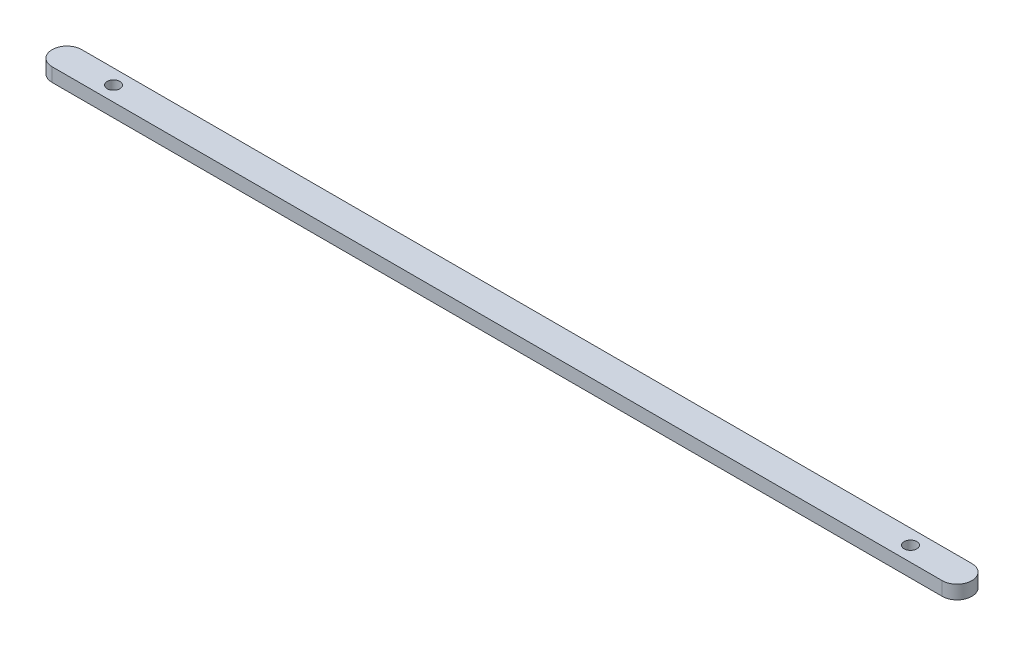
ISO-10303-21;
HEADER;
FILE_DESCRIPTION(('STEP AP214'),'2;1');
FILE_NAME('part.step','',(''),(''),'','','');
FILE_SCHEMA(('AUTOMOTIVE_DESIGN { 1 0 10303 214 1 1 1 1 }'));
ENDSEC;
DATA;
#1=APPLICATION_CONTEXT('core data for automotive mechanical design processes');
#2=APPLICATION_PROTOCOL_DEFINITION('international standard','automotive_design',2000,#1);
#3=PRODUCT_CONTEXT('',#1,'mechanical');
#4=PRODUCT('Part','Part','',(#3));
#5=PRODUCT_RELATED_PRODUCT_CATEGORY('part','',(#4));
#6=PRODUCT_DEFINITION_FORMATION('','',#4);
#7=PRODUCT_DEFINITION_CONTEXT('part definition',#1,'design');
#8=PRODUCT_DEFINITION('design','',#6,#7);
#9=PRODUCT_DEFINITION_SHAPE('','',#8);
#10=(LENGTH_UNIT() NAMED_UNIT(*) SI_UNIT(.MILLI.,.METRE.));
#11=(NAMED_UNIT(*) PLANE_ANGLE_UNIT() SI_UNIT($,.RADIAN.));
#12=(NAMED_UNIT(*) SI_UNIT($,.STERADIAN.) SOLID_ANGLE_UNIT());
#13=UNCERTAINTY_MEASURE_WITH_UNIT(LENGTH_MEASURE(1.E-05),#10,'distance_accuracy_value','');
#14=(GEOMETRIC_REPRESENTATION_CONTEXT(3) GLOBAL_UNCERTAINTY_ASSIGNED_CONTEXT((#13)) GLOBAL_UNIT_ASSIGNED_CONTEXT((#10,
#11,#12)) REPRESENTATION_CONTEXT('',''));
#15=CARTESIAN_POINT('',(0.,0.,0.));
#16=DIRECTION('',(0.,0.,1.));
#17=DIRECTION('',(1.,0.,0.));
#18=AXIS2_PLACEMENT_3D('',#15,#16,#17);
#19=CARTESIAN_POINT('',(-105.08,1.61,0.));
#20=DIRECTION('',(0.,1.,0.));
#21=DIRECTION('',(0.,0.,1.));
#22=AXIS2_PLACEMENT_3D('',#19,#20,#21);
#23=PLANE('',#22);
#24=CARTESIAN_POINT('',(-94.08,1.61,0.));
#25=DIRECTION('',(0.,1.,0.));
#26=DIRECTION('',(0.,0.,1.));
#27=AXIS2_PLACEMENT_3D('',#24,#25,#26);
#28=CIRCLE('',#27,1.49999999999999);
#29=CARTESIAN_POINT('',(-94.08,1.61,1.49999999999999));
#30=VERTEX_POINT('',#29);
#31=EDGE_CURVE('E106',#30,#30,#28,.T.);
#32=ORIENTED_EDGE('',*,*,#31,.F.);
#33=EDGE_LOOP('',(#32));
#34=FACE_BOUND('',#33,.T.);
#35=CARTESIAN_POINT('',(-105.08,1.61,0.));
#36=DIRECTION('',(0.,1.,0.));
#37=DIRECTION('',(0.,0.,1.));
#38=AXIS2_PLACEMENT_3D('',#35,#36,#37);
#39=CIRCLE('',#38,3.5);
#40=CARTESIAN_POINT('',(-105.08,1.61,-3.5));
#41=VERTEX_POINT('',#40);
#42=CARTESIAN_POINT('',(-105.08,1.61,3.5));
#43=VERTEX_POINT('',#42);
#44=EDGE_CURVE('E91',#41,#43,#39,.T.);
#45=ORIENTED_EDGE('',*,*,#44,.T.);
#46=DIRECTION('',(1.,0.,0.));
#47=VECTOR('',#46,1.);
#48=CARTESIAN_POINT('',(-105.08,1.61,3.5));
#49=LINE('',#48,#47);
#50=CARTESIAN_POINT('',(105.08,1.61,3.49999999999996));
#51=VERTEX_POINT('',#50);
#52=EDGE_CURVE('E86',#43,#51,#49,.T.);
#53=ORIENTED_EDGE('',*,*,#52,.T.);
#54=CARTESIAN_POINT('',(105.08,1.61,0.));
#55=DIRECTION('',(0.,1.,0.));
#56=DIRECTION('',(0.,0.,1.));
#57=AXIS2_PLACEMENT_3D('',#54,#55,#56);
#58=CIRCLE('',#57,3.5);
#59=CARTESIAN_POINT('',(105.08,1.61,-3.50000000000004));
#60=VERTEX_POINT('',#59);
#61=EDGE_CURVE('E89',#51,#60,#58,.T.);
#62=ORIENTED_EDGE('',*,*,#61,.T.);
#63=DIRECTION('',(-1.,0.,0.));
#64=VECTOR('',#63,1.);
#65=CARTESIAN_POINT('',(-105.08,1.61,-3.5));
#66=LINE('',#65,#64);
#67=EDGE_CURVE('E56',#60,#41,#66,.T.);
#68=ORIENTED_EDGE('',*,*,#67,.T.);
#69=EDGE_LOOP('',(#45,#53,#62,#68));
#70=FACE_BOUND('',#69,.T.);
#71=CARTESIAN_POINT('',(94.08,1.61,0.));
#72=DIRECTION('',(0.,1.,0.));
#73=DIRECTION('',(0.,0.,-1.));
#74=AXIS2_PLACEMENT_3D('',#71,#72,#73);
#75=CIRCLE('',#74,1.50000000000001);
#76=CARTESIAN_POINT('',(94.08,1.61,-1.50000000000001));
#77=VERTEX_POINT('',#76);
#78=EDGE_CURVE('E121',#77,#77,#75,.T.);
#79=ORIENTED_EDGE('',*,*,#78,.F.);
#80=EDGE_LOOP('',(#79));
#81=FACE_BOUND('',#80,.T.);
#82=ADVANCED_FACE('F39',(#34,#70,#81),#23,.T.);
#83=CARTESIAN_POINT('',(-105.08,-1.61,0.));
#84=DIRECTION('',(0.,1.,0.));
#85=DIRECTION('',(0.,0.,1.));
#86=AXIS2_PLACEMENT_3D('',#83,#84,#85);
#87=PLANE('',#86);
#88=CARTESIAN_POINT('',(-105.08,-1.61,0.));
#89=DIRECTION('',(0.,1.,0.));
#90=DIRECTION('',(0.,0.,1.));
#91=AXIS2_PLACEMENT_3D('',#88,#89,#90);
#92=CIRCLE('',#91,3.5);
#93=CARTESIAN_POINT('',(-105.08,-1.61,-3.5));
#94=VERTEX_POINT('',#93);
#95=CARTESIAN_POINT('',(-105.08,-1.61,3.5));
#96=VERTEX_POINT('',#95);
#97=EDGE_CURVE('E103',#94,#96,#92,.T.);
#98=ORIENTED_EDGE('',*,*,#97,.F.);
#99=DIRECTION('',(-1.,0.,0.));
#100=VECTOR('',#99,1.);
#101=CARTESIAN_POINT('',(-105.08,-1.61,-3.5));
#102=LINE('',#101,#100);
#103=CARTESIAN_POINT('',(105.08,-1.61,-3.50000000000004));
#104=VERTEX_POINT('',#103);
#105=EDGE_CURVE('E79',#104,#94,#102,.T.);
#106=ORIENTED_EDGE('',*,*,#105,.F.);
#107=CARTESIAN_POINT('',(105.08,-1.61,0.));
#108=DIRECTION('',(0.,1.,0.));
#109=DIRECTION('',(0.,0.,1.));
#110=AXIS2_PLACEMENT_3D('',#107,#108,#109);
#111=CIRCLE('',#110,3.5);
#112=CARTESIAN_POINT('',(105.08,-1.61,3.49999999999996));
#113=VERTEX_POINT('',#112);
#114=EDGE_CURVE('E73',#113,#104,#111,.T.);
#115=ORIENTED_EDGE('',*,*,#114,.F.);
#116=DIRECTION('',(1.,0.,0.));
#117=VECTOR('',#116,1.);
#118=CARTESIAN_POINT('',(-105.08,-1.61,3.5));
#119=LINE('',#118,#117);
#120=EDGE_CURVE('E95',#96,#113,#119,.T.);
#121=ORIENTED_EDGE('',*,*,#120,.F.);
#122=EDGE_LOOP('',(#98,#106,#115,#121));
#123=FACE_BOUND('',#122,.T.);
#124=CARTESIAN_POINT('',(-94.08,-1.61,0.));
#125=DIRECTION('',(0.,1.,0.));
#126=DIRECTION('',(0.,0.,1.));
#127=AXIS2_PLACEMENT_3D('',#124,#125,#126);
#128=CIRCLE('',#127,1.49999999999999);
#129=CARTESIAN_POINT('',(-94.08,-1.61,1.49999999999999));
#130=VERTEX_POINT('',#129);
#131=EDGE_CURVE('E118',#130,#130,#128,.T.);
#132=ORIENTED_EDGE('',*,*,#131,.T.);
#133=EDGE_LOOP('',(#132));
#134=FACE_BOUND('',#133,.T.);
#135=CARTESIAN_POINT('',(94.08,-1.61,0.));
#136=DIRECTION('',(0.,1.,0.));
#137=DIRECTION('',(0.,0.,-1.));
#138=AXIS2_PLACEMENT_3D('',#135,#136,#137);
#139=CIRCLE('',#138,1.50000000000001);
#140=CARTESIAN_POINT('',(94.08,-1.61,-1.50000000000001));
#141=VERTEX_POINT('',#140);
#142=EDGE_CURVE('E124',#141,#141,#139,.T.);
#143=ORIENTED_EDGE('',*,*,#142,.T.);
#144=EDGE_LOOP('',(#143));
#145=FACE_BOUND('',#144,.T.);
#146=ADVANCED_FACE('F114',(#123,#134,#145),#87,.F.);
#147=CARTESIAN_POINT('',(-105.08,1.61,0.));
#148=DIRECTION('',(0.,-1.,0.));
#149=DIRECTION('',(0.,0.,-1.));
#150=AXIS2_PLACEMENT_3D('',#147,#148,#149);
#151=CYLINDRICAL_SURFACE('',#150,3.5);
#152=ORIENTED_EDGE('',*,*,#97,.T.);
#153=DIRECTION('',(0.,-1.,0.));
#154=VECTOR('',#153,1.);
#155=CARTESIAN_POINT('',(-105.08,1.61,3.5));
#156=LINE('',#155,#154);
#157=EDGE_CURVE('E11',#43,#96,#156,.T.);
#158=ORIENTED_EDGE('',*,*,#157,.F.);
#159=ORIENTED_EDGE('',*,*,#44,.F.);
#160=DIRECTION('',(0.,-1.,0.));
#161=VECTOR('',#160,1.);
#162=CARTESIAN_POINT('',(-105.08,1.61,-3.5));
#163=LINE('',#162,#161);
#164=EDGE_CURVE('E99',#41,#94,#163,.T.);
#165=ORIENTED_EDGE('',*,*,#164,.T.);
#166=EDGE_LOOP('',(#152,#158,#159,#165));
#167=FACE_BOUND('',#166,.T.);
#168=ADVANCED_FACE('F41',(#167),#151,.T.);
#169=CARTESIAN_POINT('',(-105.08,1.61,3.5));
#170=DIRECTION('',(0.,0.,-1.));
#171=DIRECTION('',(-1.,0.,0.));
#172=AXIS2_PLACEMENT_3D('',#169,#170,#171);
#173=PLANE('',#172);
#174=ORIENTED_EDGE('',*,*,#120,.T.);
#175=DIRECTION('',(0.,-1.,0.));
#176=VECTOR('',#175,1.);
#177=CARTESIAN_POINT('',(105.08,1.61,3.49999999999996));
#178=LINE('',#177,#176);
#179=EDGE_CURVE('E48',#51,#113,#178,.T.);
#180=ORIENTED_EDGE('',*,*,#179,.F.);
#181=ORIENTED_EDGE('',*,*,#52,.F.);
#182=ORIENTED_EDGE('',*,*,#157,.T.);
#183=EDGE_LOOP('',(#174,#180,#181,#182));
#184=FACE_BOUND('',#183,.T.);
#185=ADVANCED_FACE('F94',(#184),#173,.F.);
#186=CARTESIAN_POINT('',(105.08,1.61,0.));
#187=DIRECTION('',(0.,-1.,0.));
#188=DIRECTION('',(0.,0.,-1.));
#189=AXIS2_PLACEMENT_3D('',#186,#187,#188);
#190=CYLINDRICAL_SURFACE('',#189,3.5);
#191=ORIENTED_EDGE('',*,*,#114,.T.);
#192=DIRECTION('',(0.,-1.,0.));
#193=VECTOR('',#192,1.);
#194=CARTESIAN_POINT('',(105.08,1.61,-3.50000000000004));
#195=LINE('',#194,#193);
#196=EDGE_CURVE('E96',#60,#104,#195,.T.);
#197=ORIENTED_EDGE('',*,*,#196,.F.);
#198=ORIENTED_EDGE('',*,*,#61,.F.);
#199=ORIENTED_EDGE('',*,*,#179,.T.);
#200=EDGE_LOOP('',(#191,#197,#198,#199));
#201=FACE_BOUND('',#200,.T.);
#202=ADVANCED_FACE('F97',(#201),#190,.T.);
#203=CARTESIAN_POINT('',(-105.08,1.61,-3.5));
#204=DIRECTION('',(0.,0.,1.));
#205=DIRECTION('',(1.,0.,0.));
#206=AXIS2_PLACEMENT_3D('',#203,#204,#205);
#207=PLANE('',#206);
#208=ORIENTED_EDGE('',*,*,#105,.T.);
#209=ORIENTED_EDGE('',*,*,#164,.F.);
#210=ORIENTED_EDGE('',*,*,#67,.F.);
#211=ORIENTED_EDGE('',*,*,#196,.T.);
#212=EDGE_LOOP('',(#208,#209,#210,#211));
#213=FACE_BOUND('',#212,.T.);
#214=ADVANCED_FACE('F111',(#213),#207,.F.);
#215=CARTESIAN_POINT('',(-94.08,1.61,0.));
#216=DIRECTION('',(0.,-1.,0.));
#217=DIRECTION('',(0.,0.,-1.));
#218=AXIS2_PLACEMENT_3D('',#215,#216,#217);
#219=CYLINDRICAL_SURFACE('',#218,1.49999999999999);
#220=ORIENTED_EDGE('',*,*,#31,.T.);
#221=EDGE_LOOP('',(#220));
#222=FACE_BOUND('',#221,.T.);
#223=ORIENTED_EDGE('',*,*,#131,.F.);
#224=EDGE_LOOP('',(#223));
#225=FACE_BOUND('',#224,.T.);
#226=ADVANCED_FACE('F141',(#222,#225),#219,.F.);
#227=CARTESIAN_POINT('',(94.08,1.61,0.));
#228=DIRECTION('',(0.,-1.,0.));
#229=DIRECTION('',(0.,0.,-1.));
#230=AXIS2_PLACEMENT_3D('',#227,#228,#229);
#231=CYLINDRICAL_SURFACE('',#230,1.50000000000001);
#232=ORIENTED_EDGE('',*,*,#78,.T.);
#233=EDGE_LOOP('',(#232));
#234=FACE_BOUND('',#233,.T.);
#235=ORIENTED_EDGE('',*,*,#142,.F.);
#236=EDGE_LOOP('',(#235));
#237=FACE_BOUND('',#236,.T.);
#238=ADVANCED_FACE('F130',(#234,#237),#231,.F.);
#239=CLOSED_SHELL('',(#82,#146,#168,#185,#202,#214,#226,#238));
#240=MANIFOLD_SOLID_BREP('B2',#239);
#241=ADVANCED_BREP_SHAPE_REPRESENTATION('',(#18,#240),#14);
#242=SHAPE_DEFINITION_REPRESENTATION(#9,#241);
ENDSEC;
END-ISO-10303-21;
